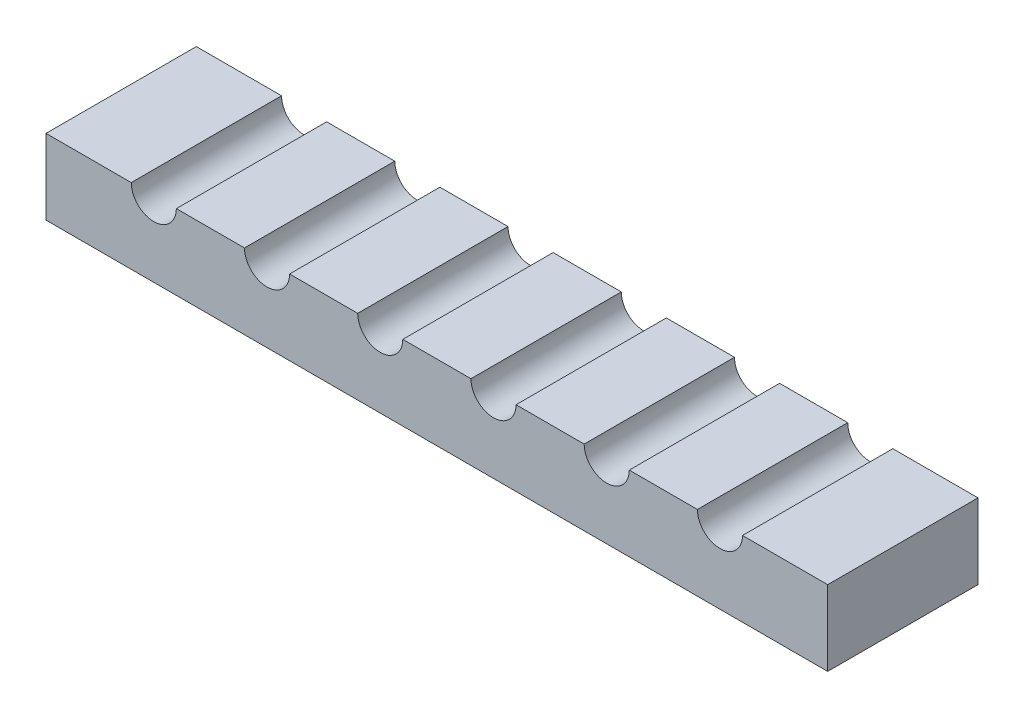
ISO-10303-21;
HEADER;
FILE_DESCRIPTION(('STEP AP214'),'2;1');
FILE_NAME('part.step','',(''),(''),'','','');
FILE_SCHEMA(('AUTOMOTIVE_DESIGN { 1 0 10303 214 1 1 1 1 }'));
ENDSEC;
DATA;
#1=APPLICATION_CONTEXT('core data for automotive mechanical design processes');
#2=APPLICATION_PROTOCOL_DEFINITION('international standard','automotive_design',2000,#1);
#3=PRODUCT_CONTEXT('',#1,'mechanical');
#4=PRODUCT('Part','Part','',(#3));
#5=PRODUCT_RELATED_PRODUCT_CATEGORY('part','',(#4));
#6=PRODUCT_DEFINITION_FORMATION('','',#4);
#7=PRODUCT_DEFINITION_CONTEXT('part definition',#1,'design');
#8=PRODUCT_DEFINITION('design','',#6,#7);
#9=PRODUCT_DEFINITION_SHAPE('','',#8);
#10=(LENGTH_UNIT() NAMED_UNIT(*) SI_UNIT(.MILLI.,.METRE.));
#11=(NAMED_UNIT(*) PLANE_ANGLE_UNIT() SI_UNIT($,.RADIAN.));
#12=(NAMED_UNIT(*) SI_UNIT($,.STERADIAN.) SOLID_ANGLE_UNIT());
#13=UNCERTAINTY_MEASURE_WITH_UNIT(LENGTH_MEASURE(1.E-05),#10,'distance_accuracy_value','');
#14=(GEOMETRIC_REPRESENTATION_CONTEXT(3) GLOBAL_UNCERTAINTY_ASSIGNED_CONTEXT((#13)) GLOBAL_UNIT_ASSIGNED_CONTEXT((#10,
#11,#12)) REPRESENTATION_CONTEXT('',''));
#15=CARTESIAN_POINT('',(0.,0.,0.));
#16=DIRECTION('',(0.,0.,1.));
#17=DIRECTION('',(1.,0.,0.));
#18=AXIS2_PLACEMENT_3D('',#15,#16,#17);
#19=CARTESIAN_POINT('',(0.,15.,0.));
#20=DIRECTION('',(0.,1.,0.));
#21=DIRECTION('',(0.,0.,1.));
#22=AXIS2_PLACEMENT_3D('',#19,#20,#21);
#23=PLANE('',#22);
#24=DIRECTION('',(0.,0.,-1.));
#25=VECTOR('',#24,1.);
#26=CARTESIAN_POINT('',(20.3333333300001,15.,244.55));
#27=LINE('',#26,#25);
#28=CARTESIAN_POINT('',(20.3333333300001,15.,-560.5));
#29=VERTEX_POINT('',#28);
#30=CARTESIAN_POINT('',(20.3333333300001,15.,-570.5));
#31=VERTEX_POINT('',#30);
#32=EDGE_CURVE('E11',#29,#31,#27,.T.);
#33=ORIENTED_EDGE('',*,*,#32,.F.);
#34=DIRECTION('',(1.,0.,0.));
#35=VECTOR('',#34,1.);
#36=CARTESIAN_POINT('',(-26.,15.,-560.5));
#37=LINE('',#36,#35);
#38=CARTESIAN_POINT('',(26.,15.,-560.5));
#39=VERTEX_POINT('',#38);
#40=EDGE_CURVE('E229',#29,#39,#37,.T.);
#41=ORIENTED_EDGE('',*,*,#40,.T.);
#42=DIRECTION('',(0.,0.,-1.));
#43=VECTOR('',#42,1.);
#44=CARTESIAN_POINT('',(26.,15.,-570.5));
#45=LINE('',#44,#43);
#46=CARTESIAN_POINT('',(26.,15.,-570.5));
#47=VERTEX_POINT('',#46);
#48=EDGE_CURVE('E167',#39,#47,#45,.T.);
#49=ORIENTED_EDGE('',*,*,#48,.T.);
#50=DIRECTION('',(-1.,0.,0.));
#51=VECTOR('',#50,1.);
#52=CARTESIAN_POINT('',(-26.,15.,-570.5));
#53=LINE('',#52,#51);
#54=EDGE_CURVE('E168',#47,#31,#53,.T.);
#55=ORIENTED_EDGE('',*,*,#54,.T.);
#56=EDGE_LOOP('',(#33,#41,#49,#55));
#57=FACE_BOUND('',#56,.T.);
#58=ADVANCED_FACE('F32',(#57),#23,.T.);
#59=DIRECTION('',(0.,0.,-1.));
#60=VECTOR('',#59,1.);
#61=CARTESIAN_POINT('',(17.3333333300001,15.,244.55));
#62=LINE('',#61,#60);
#63=CARTESIAN_POINT('',(17.33333333,15.,-570.5));
#64=VERTEX_POINT('',#63);
#65=CARTESIAN_POINT('',(17.3333333300001,15.,-560.5));
#66=VERTEX_POINT('',#65);
#67=EDGE_CURVE('E40',#64,#66,#62,.F.);
#68=ORIENTED_EDGE('',*,*,#67,.F.);
#69=CARTESIAN_POINT('',(12.800666664,15.,-570.5));
#70=VERTEX_POINT('',#69);
#71=EDGE_CURVE('E173',#64,#70,#53,.T.);
#72=ORIENTED_EDGE('',*,*,#71,.T.);
#73=DIRECTION('',(0.,0.,-1.));
#74=VECTOR('',#73,1.);
#75=CARTESIAN_POINT('',(12.800666664,15.,244.55));
#76=LINE('',#75,#74);
#77=CARTESIAN_POINT('',(12.800666664,15.,-560.5));
#78=VERTEX_POINT('',#77);
#79=EDGE_CURVE('E211',#78,#70,#76,.T.);
#80=ORIENTED_EDGE('',*,*,#79,.F.);
#81=EDGE_CURVE('E227',#78,#66,#37,.T.);
#82=ORIENTED_EDGE('',*,*,#81,.T.);
#83=EDGE_LOOP('',(#68,#72,#80,#82));
#84=FACE_BOUND('',#83,.T.);
#85=ADVANCED_FACE('F233',(#84),#23,.T.);
#86=DIRECTION('',(0.,0.,-1.));
#87=VECTOR('',#86,1.);
#88=CARTESIAN_POINT('',(9.80066666400003,15.,244.55));
#89=LINE('',#88,#87);
#90=CARTESIAN_POINT('',(9.80066666400003,15.,-570.5));
#91=VERTEX_POINT('',#90);
#92=CARTESIAN_POINT('',(9.80066666400003,15.,-560.5));
#93=VERTEX_POINT('',#92);
#94=EDGE_CURVE('E209',#91,#93,#89,.F.);
#95=ORIENTED_EDGE('',*,*,#94,.F.);
#96=CARTESIAN_POINT('',(5.26799999800001,15.,-570.5));
#97=VERTEX_POINT('',#96);
#98=EDGE_CURVE('E270',#91,#97,#53,.T.);
#99=ORIENTED_EDGE('',*,*,#98,.T.);
#100=DIRECTION('',(0.,0.,-1.));
#101=VECTOR('',#100,1.);
#102=CARTESIAN_POINT('',(5.26799999800001,15.,244.55));
#103=LINE('',#102,#101);
#104=CARTESIAN_POINT('',(5.26799999800001,15.,-560.5));
#105=VERTEX_POINT('',#104);
#106=EDGE_CURVE('E207',#105,#97,#103,.T.);
#107=ORIENTED_EDGE('',*,*,#106,.F.);
#108=EDGE_CURVE('E234',#105,#93,#37,.T.);
#109=ORIENTED_EDGE('',*,*,#108,.T.);
#110=EDGE_LOOP('',(#95,#99,#107,#109));
#111=FACE_BOUND('',#110,.T.);
#112=ADVANCED_FACE('F268',(#111),#23,.T.);
#113=DIRECTION('',(0.,0.,-1.));
#114=VECTOR('',#113,1.);
#115=CARTESIAN_POINT('',(2.26799999800001,15.,244.55));
#116=LINE('',#115,#114);
#117=CARTESIAN_POINT('',(2.26799999800001,15.,-570.5));
#118=VERTEX_POINT('',#117);
#119=CARTESIAN_POINT('',(2.26799999800001,15.,-560.5));
#120=VERTEX_POINT('',#119);
#121=EDGE_CURVE('E205',#118,#120,#116,.F.);
#122=ORIENTED_EDGE('',*,*,#121,.F.);
#123=CARTESIAN_POINT('',(-2.26466666800001,15.,-570.5));
#124=VERTEX_POINT('',#123);
#125=EDGE_CURVE('E166',#118,#124,#53,.T.);
#126=ORIENTED_EDGE('',*,*,#125,.T.);
#127=DIRECTION('',(0.,0.,-1.));
#128=VECTOR('',#127,1.);
#129=CARTESIAN_POINT('',(-2.26466666800001,15.,244.55));
#130=LINE('',#129,#128);
#131=CARTESIAN_POINT('',(-2.26466666800001,15.,-560.5));
#132=VERTEX_POINT('',#131);
#133=EDGE_CURVE('E203',#132,#124,#130,.T.);
#134=ORIENTED_EDGE('',*,*,#133,.F.);
#135=EDGE_CURVE('E236',#132,#120,#37,.T.);
#136=ORIENTED_EDGE('',*,*,#135,.T.);
#137=EDGE_LOOP('',(#122,#126,#134,#136));
#138=FACE_BOUND('',#137,.T.);
#139=ADVANCED_FACE('F278',(#138),#23,.T.);
#140=DIRECTION('',(0.,0.,-1.));
#141=VECTOR('',#140,1.);
#142=CARTESIAN_POINT('',(-5.26466666800001,15.,244.55));
#143=LINE('',#142,#141);
#144=CARTESIAN_POINT('',(-5.26466666800001,15.,-570.5));
#145=VERTEX_POINT('',#144);
#146=CARTESIAN_POINT('',(-5.26466666800001,15.,-560.5));
#147=VERTEX_POINT('',#146);
#148=EDGE_CURVE('E201',#145,#147,#143,.F.);
#149=ORIENTED_EDGE('',*,*,#148,.F.);
#150=CARTESIAN_POINT('',(-9.79733333400003,15.,-570.5));
#151=VERTEX_POINT('',#150);
#152=EDGE_CURVE('E163',#145,#151,#53,.T.);
#153=ORIENTED_EDGE('',*,*,#152,.T.);
#154=DIRECTION('',(0.,0.,-1.));
#155=VECTOR('',#154,1.);
#156=CARTESIAN_POINT('',(-9.79733333400003,15.,244.55));
#157=LINE('',#156,#155);
#158=CARTESIAN_POINT('',(-9.79733333400003,15.,-560.5));
#159=VERTEX_POINT('',#158);
#160=EDGE_CURVE('E199',#159,#151,#157,.T.);
#161=ORIENTED_EDGE('',*,*,#160,.F.);
#162=EDGE_CURVE('E291',#159,#147,#37,.T.);
#163=ORIENTED_EDGE('',*,*,#162,.T.);
#164=EDGE_LOOP('',(#149,#153,#161,#163));
#165=FACE_BOUND('',#164,.T.);
#166=ADVANCED_FACE('F288',(#165),#23,.T.);
#167=DIRECTION('',(0.,0.,-1.));
#168=VECTOR('',#167,1.);
#169=CARTESIAN_POINT('',(-12.797333334,15.,244.55));
#170=LINE('',#169,#168);
#171=CARTESIAN_POINT('',(-12.797333334,15.,-570.5));
#172=VERTEX_POINT('',#171);
#173=CARTESIAN_POINT('',(-12.797333334,15.,-560.5));
#174=VERTEX_POINT('',#173);
#175=EDGE_CURVE('E150',#172,#174,#170,.F.);
#176=ORIENTED_EDGE('',*,*,#175,.F.);
#177=CARTESIAN_POINT('',(-17.33,15.,-570.5));
#178=VERTEX_POINT('',#177);
#179=EDGE_CURVE('E158',#172,#178,#53,.T.);
#180=ORIENTED_EDGE('',*,*,#179,.T.);
#181=DIRECTION('',(0.,0.,-1.));
#182=VECTOR('',#181,1.);
#183=CARTESIAN_POINT('',(-17.33,15.,244.55));
#184=LINE('',#183,#182);
#185=CARTESIAN_POINT('',(-17.33,15.,-560.5));
#186=VERTEX_POINT('',#185);
#187=EDGE_CURVE('E142',#186,#178,#184,.T.);
#188=ORIENTED_EDGE('',*,*,#187,.F.);
#189=EDGE_CURVE('E240',#186,#174,#37,.T.);
#190=ORIENTED_EDGE('',*,*,#189,.T.);
#191=EDGE_LOOP('',(#176,#180,#188,#190));
#192=FACE_BOUND('',#191,.T.);
#193=ADVANCED_FACE('F162',(#192),#23,.T.);
#194=CARTESIAN_POINT('',(-26.,15.,-570.5));
#195=DIRECTION('',(1.,0.,0.));
#196=DIRECTION('',(0.,0.,-1.));
#197=AXIS2_PLACEMENT_3D('',#194,#195,#196);
#198=PLANE('',#197);
#199=DIRECTION('',(0.,0.,1.));
#200=VECTOR('',#199,1.);
#201=CARTESIAN_POINT('',(-26.,10.,-570.5));
#202=LINE('',#201,#200);
#203=CARTESIAN_POINT('',(-26.,10.,-570.5));
#204=VERTEX_POINT('',#203);
#205=CARTESIAN_POINT('',(-26.,10.,-560.5));
#206=VERTEX_POINT('',#205);
#207=EDGE_CURVE('E175',#204,#206,#202,.T.);
#208=ORIENTED_EDGE('',*,*,#207,.T.);
#209=DIRECTION('',(0.,-1.,0.));
#210=VECTOR('',#209,1.);
#211=CARTESIAN_POINT('',(-26.,15.,-560.5));
#212=LINE('',#211,#210);
#213=CARTESIAN_POINT('',(-26.,15.,-560.5));
#214=VERTEX_POINT('',#213);
#215=EDGE_CURVE('E194',#214,#206,#212,.T.);
#216=ORIENTED_EDGE('',*,*,#215,.F.);
#217=DIRECTION('',(0.,0.,1.));
#218=VECTOR('',#217,1.);
#219=CARTESIAN_POINT('',(-26.,15.,-570.5));
#220=LINE('',#219,#218);
#221=CARTESIAN_POINT('',(-26.,15.,-570.5));
#222=VERTEX_POINT('',#221);
#223=EDGE_CURVE('E185',#222,#214,#220,.T.);
#224=ORIENTED_EDGE('',*,*,#223,.F.);
#225=DIRECTION('',(0.,-1.,0.));
#226=VECTOR('',#225,1.);
#227=CARTESIAN_POINT('',(-26.,15.,-570.5));
#228=LINE('',#227,#226);
#229=EDGE_CURVE('E172',#222,#204,#228,.T.);
#230=ORIENTED_EDGE('',*,*,#229,.T.);
#231=EDGE_LOOP('',(#208,#216,#224,#230));
#232=FACE_BOUND('',#231,.T.);
#233=ADVANCED_FACE('F34',(#232),#198,.F.);
#234=CARTESIAN_POINT('',(-26.,15.,-560.5));
#235=DIRECTION('',(0.,0.,-1.));
#236=DIRECTION('',(-1.,0.,0.));
#237=AXIS2_PLACEMENT_3D('',#234,#235,#236);
#238=PLANE('',#237);
#239=ORIENTED_EDGE('',*,*,#40,.F.);
#240=CARTESIAN_POINT('',(18.8333333300001,15.,-560.5));
#241=DIRECTION('',(0.,0.,-1.));
#242=DIRECTION('',(-1.,0.,0.));
#243=AXIS2_PLACEMENT_3D('',#240,#241,#242);
#244=CIRCLE('',#243,1.5);
#245=EDGE_CURVE('E179',#29,#66,#244,.T.);
#246=ORIENTED_EDGE('',*,*,#245,.T.);
#247=ORIENTED_EDGE('',*,*,#81,.F.);
#248=CARTESIAN_POINT('',(11.300666664,15.,-560.5));
#249=DIRECTION('',(0.,0.,-1.));
#250=DIRECTION('',(-1.,0.,0.));
#251=AXIS2_PLACEMENT_3D('',#248,#249,#250);
#252=CIRCLE('',#251,1.5);
#253=EDGE_CURVE('E230',#78,#93,#252,.T.);
#254=ORIENTED_EDGE('',*,*,#253,.T.);
#255=ORIENTED_EDGE('',*,*,#108,.F.);
#256=CARTESIAN_POINT('',(3.76799999800001,15.,-560.5));
#257=DIRECTION('',(0.,0.,-1.));
#258=DIRECTION('',(-1.,0.,0.));
#259=AXIS2_PLACEMENT_3D('',#256,#257,#258);
#260=CIRCLE('',#259,1.5);
#261=EDGE_CURVE('E244',#105,#120,#260,.T.);
#262=ORIENTED_EDGE('',*,*,#261,.T.);
#263=ORIENTED_EDGE('',*,*,#135,.F.);
#264=CARTESIAN_POINT('',(-3.76466666800001,15.,-560.5));
#265=DIRECTION('',(0.,0.,-1.));
#266=DIRECTION('',(-1.,0.,0.));
#267=AXIS2_PLACEMENT_3D('',#264,#265,#266);
#268=CIRCLE('',#267,1.5);
#269=EDGE_CURVE('E247',#132,#147,#268,.T.);
#270=ORIENTED_EDGE('',*,*,#269,.T.);
#271=ORIENTED_EDGE('',*,*,#162,.F.);
#272=CARTESIAN_POINT('',(-11.297333334,15.,-560.5));
#273=DIRECTION('',(0.,0.,-1.));
#274=DIRECTION('',(-1.,0.,0.));
#275=AXIS2_PLACEMENT_3D('',#272,#273,#274);
#276=CIRCLE('',#275,1.5);
#277=EDGE_CURVE('E250',#159,#174,#276,.T.);
#278=ORIENTED_EDGE('',*,*,#277,.T.);
#279=ORIENTED_EDGE('',*,*,#189,.F.);
#280=CARTESIAN_POINT('',(-18.83,15.,-560.5));
#281=DIRECTION('',(0.,0.,-1.));
#282=DIRECTION('',(-1.,0.,0.));
#283=AXIS2_PLACEMENT_3D('',#280,#281,#282);
#284=CIRCLE('',#283,1.5);
#285=CARTESIAN_POINT('',(-20.33,15.,-560.5));
#286=VERTEX_POINT('',#285);
#287=EDGE_CURVE('E145',#186,#286,#284,.T.);
#288=ORIENTED_EDGE('',*,*,#287,.T.);
#289=EDGE_CURVE('E237',#214,#286,#37,.T.);
#290=ORIENTED_EDGE('',*,*,#289,.F.);
#291=ORIENTED_EDGE('',*,*,#215,.T.);
#292=DIRECTION('',(1.,0.,0.));
#293=VECTOR('',#292,1.);
#294=CARTESIAN_POINT('',(-26.,10.,-560.5));
#295=LINE('',#294,#293);
#296=CARTESIAN_POINT('',(26.,10.,-560.5));
#297=VERTEX_POINT('',#296);
#298=EDGE_CURVE('E178',#206,#297,#295,.T.);
#299=ORIENTED_EDGE('',*,*,#298,.T.);
#300=DIRECTION('',(0.,-1.,0.));
#301=VECTOR('',#300,1.);
#302=CARTESIAN_POINT('',(26.,15.,-560.5));
#303=LINE('',#302,#301);
#304=EDGE_CURVE('E191',#39,#297,#303,.T.);
#305=ORIENTED_EDGE('',*,*,#304,.F.);
#306=EDGE_LOOP('',(#239,#246,#247,#254,#255,#262,#263,#270,#271,#278,#279,#288,#290,#291,#299,#305));
#307=FACE_BOUND('',#306,.T.);
#308=ADVANCED_FACE('F225',(#307),#238,.F.);
#309=CARTESIAN_POINT('',(26.,15.,-570.5));
#310=DIRECTION('',(-1.,0.,0.));
#311=DIRECTION('',(0.,0.,1.));
#312=AXIS2_PLACEMENT_3D('',#309,#310,#311);
#313=PLANE('',#312);
#314=DIRECTION('',(0.,0.,-1.));
#315=VECTOR('',#314,1.);
#316=CARTESIAN_POINT('',(26.,10.,-570.5));
#317=LINE('',#316,#315);
#318=CARTESIAN_POINT('',(26.,10.,-570.5));
#319=VERTEX_POINT('',#318);
#320=EDGE_CURVE('E181',#297,#319,#317,.T.);
#321=ORIENTED_EDGE('',*,*,#320,.T.);
#322=DIRECTION('',(0.,-1.,0.));
#323=VECTOR('',#322,1.);
#324=CARTESIAN_POINT('',(26.,15.,-570.5));
#325=LINE('',#324,#323);
#326=EDGE_CURVE('E188',#47,#319,#325,.T.);
#327=ORIENTED_EDGE('',*,*,#326,.F.);
#328=ORIENTED_EDGE('',*,*,#48,.F.);
#329=ORIENTED_EDGE('',*,*,#304,.T.);
#330=EDGE_LOOP('',(#321,#327,#328,#329));
#331=FACE_BOUND('',#330,.T.);
#332=ADVANCED_FACE('F320',(#331),#313,.F.);
#333=CARTESIAN_POINT('',(-26.,15.,-570.5));
#334=DIRECTION('',(0.,0.,1.));
#335=DIRECTION('',(1.,0.,0.));
#336=AXIS2_PLACEMENT_3D('',#333,#334,#335);
#337=PLANE('',#336);
#338=ORIENTED_EDGE('',*,*,#71,.F.);
#339=CARTESIAN_POINT('',(18.8333333300001,15.,-570.5));
#340=DIRECTION('',(0.,0.,-1.));
#341=DIRECTION('',(-1.,0.,0.));
#342=AXIS2_PLACEMENT_3D('',#339,#340,#341);
#343=CIRCLE('',#342,1.5);
#344=EDGE_CURVE('E218',#31,#64,#343,.T.);
#345=ORIENTED_EDGE('',*,*,#344,.F.);
#346=ORIENTED_EDGE('',*,*,#54,.F.);
#347=ORIENTED_EDGE('',*,*,#326,.T.);
#348=DIRECTION('',(-1.,0.,0.));
#349=VECTOR('',#348,1.);
#350=CARTESIAN_POINT('',(-26.,10.,-570.5));
#351=LINE('',#350,#349);
#352=EDGE_CURVE('E183',#319,#204,#351,.T.);
#353=ORIENTED_EDGE('',*,*,#352,.T.);
#354=ORIENTED_EDGE('',*,*,#229,.F.);
#355=CARTESIAN_POINT('',(-20.33,15.,-570.5));
#356=VERTEX_POINT('',#355);
#357=EDGE_CURVE('E160',#356,#222,#53,.T.);
#358=ORIENTED_EDGE('',*,*,#357,.F.);
#359=CARTESIAN_POINT('',(-18.83,15.,-570.5));
#360=DIRECTION('',(0.,0.,-1.));
#361=DIRECTION('',(-1.,0.,0.));
#362=AXIS2_PLACEMENT_3D('',#359,#360,#361);
#363=CIRCLE('',#362,1.5);
#364=EDGE_CURVE('E47',#178,#356,#363,.T.);
#365=ORIENTED_EDGE('',*,*,#364,.F.);
#366=ORIENTED_EDGE('',*,*,#179,.F.);
#367=CARTESIAN_POINT('',(-11.297333334,15.,-570.5));
#368=DIRECTION('',(0.,0.,-1.));
#369=DIRECTION('',(-1.,0.,0.));
#370=AXIS2_PLACEMENT_3D('',#367,#368,#369);
#371=CIRCLE('',#370,1.5);
#372=EDGE_CURVE('E55',#151,#172,#371,.T.);
#373=ORIENTED_EDGE('',*,*,#372,.F.);
#374=ORIENTED_EDGE('',*,*,#152,.F.);
#375=CARTESIAN_POINT('',(-3.76466666800001,15.,-570.5));
#376=DIRECTION('',(0.,0.,-1.));
#377=DIRECTION('',(-1.,0.,0.));
#378=AXIS2_PLACEMENT_3D('',#375,#376,#377);
#379=CIRCLE('',#378,1.5);
#380=EDGE_CURVE('E255',#124,#145,#379,.T.);
#381=ORIENTED_EDGE('',*,*,#380,.F.);
#382=ORIENTED_EDGE('',*,*,#125,.F.);
#383=CARTESIAN_POINT('',(3.76799999800001,15.,-570.5));
#384=DIRECTION('',(0.,0.,-1.));
#385=DIRECTION('',(-1.,0.,0.));
#386=AXIS2_PLACEMENT_3D('',#383,#384,#385);
#387=CIRCLE('',#386,1.5);
#388=EDGE_CURVE('E257',#97,#118,#387,.T.);
#389=ORIENTED_EDGE('',*,*,#388,.F.);
#390=ORIENTED_EDGE('',*,*,#98,.F.);
#391=CARTESIAN_POINT('',(11.300666664,15.,-570.5));
#392=DIRECTION('',(0.,0.,-1.));
#393=DIRECTION('',(-1.,0.,0.));
#394=AXIS2_PLACEMENT_3D('',#391,#392,#393);
#395=CIRCLE('',#394,1.5);
#396=EDGE_CURVE('E259',#70,#91,#395,.T.);
#397=ORIENTED_EDGE('',*,*,#396,.F.);
#398=EDGE_LOOP('',(#338,#345,#346,#347,#353,#354,#358,#365,#366,#373,#374,#381,#382,#389,#390,#397));
#399=FACE_BOUND('',#398,.T.);
#400=ADVANCED_FACE('F157',(#399),#337,.F.);
#401=DIRECTION('',(0.,0.,-1.));
#402=VECTOR('',#401,1.);
#403=CARTESIAN_POINT('',(-20.33,15.,244.55));
#404=LINE('',#403,#402);
#405=EDGE_CURVE('E151',#356,#286,#404,.F.);
#406=ORIENTED_EDGE('',*,*,#405,.F.);
#407=ORIENTED_EDGE('',*,*,#357,.T.);
#408=ORIENTED_EDGE('',*,*,#223,.T.);
#409=ORIENTED_EDGE('',*,*,#289,.T.);
#410=EDGE_LOOP('',(#406,#407,#408,#409));
#411=FACE_BOUND('',#410,.T.);
#412=ADVANCED_FACE('F306',(#411),#23,.T.);
#413=CARTESIAN_POINT('',(0.,10.,0.));
#414=DIRECTION('',(0.,1.,0.));
#415=DIRECTION('',(0.,0.,1.));
#416=AXIS2_PLACEMENT_3D('',#413,#414,#415);
#417=PLANE('',#416);
#418=ORIENTED_EDGE('',*,*,#207,.F.);
#419=ORIENTED_EDGE('',*,*,#352,.F.);
#420=ORIENTED_EDGE('',*,*,#320,.F.);
#421=ORIENTED_EDGE('',*,*,#298,.F.);
#422=EDGE_LOOP('',(#418,#419,#420,#421));
#423=FACE_BOUND('',#422,.T.);
#424=ADVANCED_FACE('F313',(#423),#417,.F.);
#425=CARTESIAN_POINT('',(-18.83,15.,244.55));
#426=DIRECTION('',(0.,0.,-1.));
#427=DIRECTION('',(-1.,0.,0.));
#428=AXIS2_PLACEMENT_3D('',#425,#426,#427);
#429=CYLINDRICAL_SURFACE('',#428,1.5);
#430=ORIENTED_EDGE('',*,*,#187,.T.);
#431=ORIENTED_EDGE('',*,*,#364,.T.);
#432=ORIENTED_EDGE('',*,*,#405,.T.);
#433=ORIENTED_EDGE('',*,*,#287,.F.);
#434=EDGE_LOOP('',(#430,#431,#432,#433));
#435=FACE_BOUND('',#434,.T.);
#436=ADVANCED_FACE('F143',(#435),#429,.F.);
#437=CARTESIAN_POINT('',(-11.297333334,15.,244.55));
#438=DIRECTION('',(0.,0.,-1.));
#439=DIRECTION('',(-1.,0.,0.));
#440=AXIS2_PLACEMENT_3D('',#437,#438,#439);
#441=CYLINDRICAL_SURFACE('',#440,1.5);
#442=ORIENTED_EDGE('',*,*,#160,.T.);
#443=ORIENTED_EDGE('',*,*,#372,.T.);
#444=ORIENTED_EDGE('',*,*,#175,.T.);
#445=ORIENTED_EDGE('',*,*,#277,.F.);
#446=EDGE_LOOP('',(#442,#443,#444,#445));
#447=FACE_BOUND('',#446,.T.);
#448=ADVANCED_FACE('F301',(#447),#441,.F.);
#449=CARTESIAN_POINT('',(-3.76466666800001,15.,244.55));
#450=DIRECTION('',(0.,0.,-1.));
#451=DIRECTION('',(-1.,0.,0.));
#452=AXIS2_PLACEMENT_3D('',#449,#450,#451);
#453=CYLINDRICAL_SURFACE('',#452,1.5);
#454=ORIENTED_EDGE('',*,*,#133,.T.);
#455=ORIENTED_EDGE('',*,*,#380,.T.);
#456=ORIENTED_EDGE('',*,*,#148,.T.);
#457=ORIENTED_EDGE('',*,*,#269,.F.);
#458=EDGE_LOOP('',(#454,#455,#456,#457));
#459=FACE_BOUND('',#458,.T.);
#460=ADVANCED_FACE('F285',(#459),#453,.F.);
#461=CARTESIAN_POINT('',(3.76799999800001,15.,244.55));
#462=DIRECTION('',(0.,0.,-1.));
#463=DIRECTION('',(-1.,0.,0.));
#464=AXIS2_PLACEMENT_3D('',#461,#462,#463);
#465=CYLINDRICAL_SURFACE('',#464,1.5);
#466=ORIENTED_EDGE('',*,*,#106,.T.);
#467=ORIENTED_EDGE('',*,*,#388,.T.);
#468=ORIENTED_EDGE('',*,*,#121,.T.);
#469=ORIENTED_EDGE('',*,*,#261,.F.);
#470=EDGE_LOOP('',(#466,#467,#468,#469));
#471=FACE_BOUND('',#470,.T.);
#472=ADVANCED_FACE('F293',(#471),#465,.F.);
#473=CARTESIAN_POINT('',(11.300666664,15.,244.55));
#474=DIRECTION('',(0.,0.,-1.));
#475=DIRECTION('',(-1.,0.,0.));
#476=AXIS2_PLACEMENT_3D('',#473,#474,#475);
#477=CYLINDRICAL_SURFACE('',#476,1.5);
#478=ORIENTED_EDGE('',*,*,#79,.T.);
#479=ORIENTED_EDGE('',*,*,#396,.T.);
#480=ORIENTED_EDGE('',*,*,#94,.T.);
#481=ORIENTED_EDGE('',*,*,#253,.F.);
#482=EDGE_LOOP('',(#478,#479,#480,#481));
#483=FACE_BOUND('',#482,.T.);
#484=ADVANCED_FACE('F264',(#483),#477,.F.);
#485=CARTESIAN_POINT('',(18.8333333300001,15.,244.55));
#486=DIRECTION('',(0.,0.,-1.));
#487=DIRECTION('',(-1.,0.,0.));
#488=AXIS2_PLACEMENT_3D('',#485,#486,#487);
#489=CYLINDRICAL_SURFACE('',#488,1.5);
#490=ORIENTED_EDGE('',*,*,#32,.T.);
#491=ORIENTED_EDGE('',*,*,#344,.T.);
#492=ORIENTED_EDGE('',*,*,#67,.T.);
#493=ORIENTED_EDGE('',*,*,#245,.F.);
#494=EDGE_LOOP('',(#490,#491,#492,#493));
#495=FACE_BOUND('',#494,.T.);
#496=ADVANCED_FACE('F215',(#495),#489,.F.);
#497=CLOSED_SHELL('',(#58,#85,#112,#139,#166,#193,#233,#308,#332,#400,#412,#424,#436,#448,#460,
#472,#484,#496));
#498=MANIFOLD_SOLID_BREP('B2',#497);
#499=ADVANCED_BREP_SHAPE_REPRESENTATION('',(#18,#498),#14);
#500=SHAPE_DEFINITION_REPRESENTATION(#9,#499);
ENDSEC;
END-ISO-10303-21;
